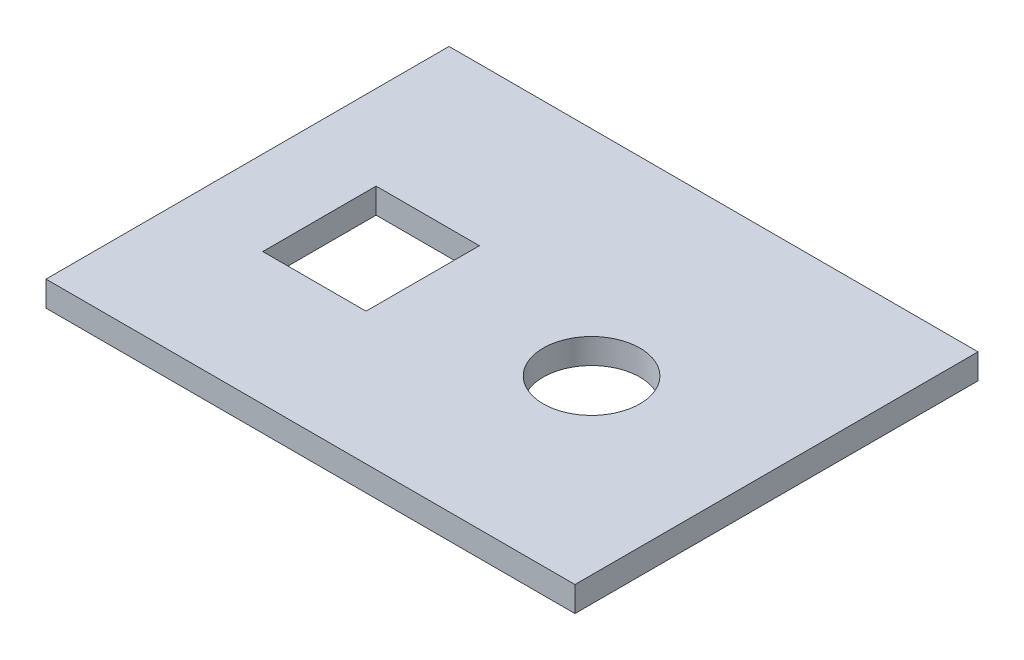
ISO-10303-21;
HEADER;
FILE_DESCRIPTION(('STEP AP214'),'2;1');
FILE_NAME('part.step','',(''),(''),'','','');
FILE_SCHEMA(('AUTOMOTIVE_DESIGN { 1 0 10303 214 1 1 1 1 }'));
ENDSEC;
DATA;
#1=APPLICATION_CONTEXT('core data for automotive mechanical design processes');
#2=APPLICATION_PROTOCOL_DEFINITION('international standard','automotive_design',2000,#1);
#3=PRODUCT_CONTEXT('',#1,'mechanical');
#4=PRODUCT('Part','Part','',(#3));
#5=PRODUCT_RELATED_PRODUCT_CATEGORY('part','',(#4));
#6=PRODUCT_DEFINITION_FORMATION('','',#4);
#7=PRODUCT_DEFINITION_CONTEXT('part definition',#1,'design');
#8=PRODUCT_DEFINITION('design','',#6,#7);
#9=PRODUCT_DEFINITION_SHAPE('','',#8);
#10=(LENGTH_UNIT() NAMED_UNIT(*) SI_UNIT(.MILLI.,.METRE.));
#11=(NAMED_UNIT(*) PLANE_ANGLE_UNIT() SI_UNIT($,.RADIAN.));
#12=(NAMED_UNIT(*) SI_UNIT($,.STERADIAN.) SOLID_ANGLE_UNIT());
#13=UNCERTAINTY_MEASURE_WITH_UNIT(LENGTH_MEASURE(1.E-05),#10,'distance_accuracy_value','');
#14=(GEOMETRIC_REPRESENTATION_CONTEXT(3) GLOBAL_UNCERTAINTY_ASSIGNED_CONTEXT((#13)) GLOBAL_UNIT_ASSIGNED_CONTEXT((#10,
#11,#12)) REPRESENTATION_CONTEXT('',''));
#15=CARTESIAN_POINT('',(0.,0.,0.));
#16=DIRECTION('',(0.,0.,1.));
#17=DIRECTION('',(1.,0.,0.));
#18=AXIS2_PLACEMENT_3D('',#15,#16,#17);
#19=CARTESIAN_POINT('',(0.,10.,0.));
#20=DIRECTION('',(0.,1.,0.));
#21=DIRECTION('',(0.,0.,1.));
#22=AXIS2_PLACEMENT_3D('',#19,#20,#21);
#23=PLANE('',#22);
#24=DIRECTION('',(-1.,0.,0.));
#25=VECTOR('',#24,1.);
#26=CARTESIAN_POINT('',(0.,10.,22.5));
#27=LINE('',#26,#25);
#28=CARTESIAN_POINT('',(-25.4527074928853,10.,22.5));
#29=VERTEX_POINT('',#28);
#30=CARTESIAN_POINT('',(-66.4527074928853,10.,22.5));
#31=VERTEX_POINT('',#30);
#32=EDGE_CURVE('E186',#29,#31,#27,.T.);
#33=ORIENTED_EDGE('',*,*,#32,.T.);
#34=DIRECTION('',(0.,0.,-1.));
#35=VECTOR('',#34,1.);
#36=CARTESIAN_POINT('',(-66.4527074928853,10.,0.));
#37=LINE('',#36,#35);
#38=CARTESIAN_POINT('',(-66.4527074928853,10.,-22.5));
#39=VERTEX_POINT('',#38);
#40=EDGE_CURVE('E182',#31,#39,#37,.T.);
#41=ORIENTED_EDGE('',*,*,#40,.T.);
#42=DIRECTION('',(1.,0.,0.));
#43=VECTOR('',#42,1.);
#44=CARTESIAN_POINT('',(0.,10.,-22.5));
#45=LINE('',#44,#43);
#46=CARTESIAN_POINT('',(-25.4527074928853,10.,-22.5));
#47=VERTEX_POINT('',#46);
#48=EDGE_CURVE('E192',#39,#47,#45,.T.);
#49=ORIENTED_EDGE('',*,*,#48,.T.);
#50=DIRECTION('',(0.,0.,1.));
#51=VECTOR('',#50,1.);
#52=CARTESIAN_POINT('',(-25.4527074928853,10.,0.));
#53=LINE('',#52,#51);
#54=EDGE_CURVE('E122',#47,#29,#53,.T.);
#55=ORIENTED_EDGE('',*,*,#54,.T.);
#56=EDGE_LOOP('',(#33,#41,#49,#55));
#57=FACE_BOUND('',#56,.T.);
#58=DIRECTION('',(-1.,0.,0.));
#59=VECTOR('',#58,1.);
#60=CARTESIAN_POINT('',(110.,10.,-85.));
#61=LINE('',#60,#59);
#62=CARTESIAN_POINT('',(110.,10.,-85.));
#63=VERTEX_POINT('',#62);
#64=CARTESIAN_POINT('',(-100.,10.,-85.));
#65=VERTEX_POINT('',#64);
#66=EDGE_CURVE('E152',#63,#65,#61,.T.);
#67=ORIENTED_EDGE('',*,*,#66,.T.);
#68=DIRECTION('',(0.,0.,1.));
#69=VECTOR('',#68,1.);
#70=CARTESIAN_POINT('',(-100.,10.,-85.));
#71=LINE('',#70,#69);
#72=CARTESIAN_POINT('',(-100.,10.,75.));
#73=VERTEX_POINT('',#72);
#74=EDGE_CURVE('E173',#65,#73,#71,.T.);
#75=ORIENTED_EDGE('',*,*,#74,.T.);
#76=DIRECTION('',(-1.,0.,0.));
#77=VECTOR('',#76,1.);
#78=CARTESIAN_POINT('',(110.,10.,75.));
#79=LINE('',#78,#77);
#80=CARTESIAN_POINT('',(110.,10.,75.));
#81=VERTEX_POINT('',#80);
#82=EDGE_CURVE('E169',#81,#73,#79,.T.);
#83=ORIENTED_EDGE('',*,*,#82,.F.);
#84=DIRECTION('',(0.,0.,1.));
#85=VECTOR('',#84,1.);
#86=CARTESIAN_POINT('',(110.,10.,-85.));
#87=LINE('',#86,#85);
#88=EDGE_CURVE('E147',#63,#81,#87,.T.);
#89=ORIENTED_EDGE('',*,*,#88,.F.);
#90=EDGE_LOOP('',(#67,#75,#83,#89));
#91=FACE_BOUND('',#90,.T.);
#92=CARTESIAN_POINT('',(41.585,10.,0.));
#93=DIRECTION('',(0.,1.,0.));
#94=DIRECTION('',(0.,0.,1.));
#95=AXIS2_PLACEMENT_3D('',#92,#93,#94);
#96=CIRCLE('',#95,19.2);
#97=CARTESIAN_POINT('',(41.585,10.,19.2));
#98=VERTEX_POINT('',#97);
#99=EDGE_CURVE('E165',#98,#98,#96,.F.);
#100=ORIENTED_EDGE('',*,*,#99,.T.);
#101=EDGE_LOOP('',(#100));
#102=FACE_BOUND('',#101,.T.);
#103=ADVANCED_FACE('F45',(#57,#91,#102),#23,.T.);
#104=CARTESIAN_POINT('',(0.,0.,0.));
#105=DIRECTION('',(0.,1.,0.));
#106=DIRECTION('',(0.,0.,1.));
#107=AXIS2_PLACEMENT_3D('',#104,#105,#106);
#108=PLANE('',#107);
#109=DIRECTION('',(-1.,0.,0.));
#110=VECTOR('',#109,1.);
#111=CARTESIAN_POINT('',(110.,0.,-85.));
#112=LINE('',#111,#110);
#113=CARTESIAN_POINT('',(110.,0.,-85.));
#114=VERTEX_POINT('',#113);
#115=CARTESIAN_POINT('',(-100.,0.,-85.));
#116=VERTEX_POINT('',#115);
#117=EDGE_CURVE('E161',#114,#116,#112,.T.);
#118=ORIENTED_EDGE('',*,*,#117,.F.);
#119=DIRECTION('',(0.,0.,1.));
#120=VECTOR('',#119,1.);
#121=CARTESIAN_POINT('',(110.,0.,-85.));
#122=LINE('',#121,#120);
#123=CARTESIAN_POINT('',(110.,0.,75.));
#124=VERTEX_POINT('',#123);
#125=EDGE_CURVE('E148',#114,#124,#122,.T.);
#126=ORIENTED_EDGE('',*,*,#125,.T.);
#127=DIRECTION('',(-1.,0.,0.));
#128=VECTOR('',#127,1.);
#129=CARTESIAN_POINT('',(110.,0.,75.));
#130=LINE('',#129,#128);
#131=CARTESIAN_POINT('',(-100.,0.,75.));
#132=VERTEX_POINT('',#131);
#133=EDGE_CURVE('E153',#124,#132,#130,.T.);
#134=ORIENTED_EDGE('',*,*,#133,.T.);
#135=DIRECTION('',(0.,0.,1.));
#136=VECTOR('',#135,1.);
#137=CARTESIAN_POINT('',(-100.,0.,-85.));
#138=LINE('',#137,#136);
#139=EDGE_CURVE('E157',#116,#132,#138,.T.);
#140=ORIENTED_EDGE('',*,*,#139,.F.);
#141=EDGE_LOOP('',(#118,#126,#134,#140));
#142=FACE_BOUND('',#141,.T.);
#143=DIRECTION('',(0.,0.,-1.));
#144=VECTOR('',#143,1.);
#145=CARTESIAN_POINT('',(-66.4527074928853,0.,0.));
#146=LINE('',#145,#144);
#147=CARTESIAN_POINT('',(-66.4527074928853,0.,22.5));
#148=VERTEX_POINT('',#147);
#149=CARTESIAN_POINT('',(-66.4527074928853,0.,-22.5));
#150=VERTEX_POINT('',#149);
#151=EDGE_CURVE('E11',#148,#150,#146,.T.);
#152=ORIENTED_EDGE('',*,*,#151,.F.);
#153=DIRECTION('',(-1.,0.,0.));
#154=VECTOR('',#153,1.);
#155=CARTESIAN_POINT('',(0.,0.,22.5));
#156=LINE('',#155,#154);
#157=CARTESIAN_POINT('',(-25.4527074928853,0.,22.5));
#158=VERTEX_POINT('',#157);
#159=EDGE_CURVE('E55',#158,#148,#156,.T.);
#160=ORIENTED_EDGE('',*,*,#159,.F.);
#161=DIRECTION('',(0.,0.,1.));
#162=VECTOR('',#161,1.);
#163=CARTESIAN_POINT('',(-25.4527074928853,0.,0.));
#164=LINE('',#163,#162);
#165=CARTESIAN_POINT('',(-25.4527074928853,0.,-22.5));
#166=VERTEX_POINT('',#165);
#167=EDGE_CURVE('E114',#166,#158,#164,.T.);
#168=ORIENTED_EDGE('',*,*,#167,.F.);
#169=DIRECTION('',(1.,0.,0.));
#170=VECTOR('',#169,1.);
#171=CARTESIAN_POINT('',(0.,0.,-22.5));
#172=LINE('',#171,#170);
#173=EDGE_CURVE('E108',#150,#166,#172,.T.);
#174=ORIENTED_EDGE('',*,*,#173,.F.);
#175=EDGE_LOOP('',(#152,#160,#168,#174));
#176=FACE_BOUND('',#175,.T.);
#177=CARTESIAN_POINT('',(41.585,0.,0.));
#178=DIRECTION('',(0.,1.,0.));
#179=DIRECTION('',(0.,0.,1.));
#180=AXIS2_PLACEMENT_3D('',#177,#178,#179);
#181=CIRCLE('',#180,19.2);
#182=CARTESIAN_POINT('',(41.585,0.,19.2));
#183=VERTEX_POINT('',#182);
#184=EDGE_CURVE('E49',#183,#183,#181,.F.);
#185=ORIENTED_EDGE('',*,*,#184,.F.);
#186=EDGE_LOOP('',(#185));
#187=FACE_BOUND('',#186,.T.);
#188=ADVANCED_FACE('F128',(#142,#176,#187),#108,.F.);
#189=CARTESIAN_POINT('',(110.,10.,-85.));
#190=DIRECTION('',(0.,0.,1.));
#191=DIRECTION('',(1.,0.,0.));
#192=AXIS2_PLACEMENT_3D('',#189,#190,#191);
#193=PLANE('',#192);
#194=ORIENTED_EDGE('',*,*,#117,.T.);
#195=DIRECTION('',(0.,-1.,0.));
#196=VECTOR('',#195,1.);
#197=CARTESIAN_POINT('',(-100.,10.,-85.));
#198=LINE('',#197,#196);
#199=EDGE_CURVE('E115',#65,#116,#198,.T.);
#200=ORIENTED_EDGE('',*,*,#199,.F.);
#201=ORIENTED_EDGE('',*,*,#66,.F.);
#202=DIRECTION('',(0.,-1.,0.));
#203=VECTOR('',#202,1.);
#204=CARTESIAN_POINT('',(110.,10.,-85.));
#205=LINE('',#204,#203);
#206=EDGE_CURVE('E144',#63,#114,#205,.T.);
#207=ORIENTED_EDGE('',*,*,#206,.T.);
#208=EDGE_LOOP('',(#194,#200,#201,#207));
#209=FACE_BOUND('',#208,.T.);
#210=ADVANCED_FACE('F47',(#209),#193,.F.);
#211=CARTESIAN_POINT('',(-100.,10.,-85.));
#212=DIRECTION('',(1.,0.,0.));
#213=DIRECTION('',(0.,0.,-1.));
#214=AXIS2_PLACEMENT_3D('',#211,#212,#213);
#215=PLANE('',#214);
#216=ORIENTED_EDGE('',*,*,#139,.T.);
#217=DIRECTION('',(0.,-1.,0.));
#218=VECTOR('',#217,1.);
#219=CARTESIAN_POINT('',(-100.,10.,75.));
#220=LINE('',#219,#218);
#221=EDGE_CURVE('E138',#73,#132,#220,.T.);
#222=ORIENTED_EDGE('',*,*,#221,.F.);
#223=ORIENTED_EDGE('',*,*,#74,.F.);
#224=ORIENTED_EDGE('',*,*,#199,.T.);
#225=EDGE_LOOP('',(#216,#222,#223,#224));
#226=FACE_BOUND('',#225,.T.);
#227=ADVANCED_FACE('F231',(#226),#215,.F.);
#228=CARTESIAN_POINT('',(110.,10.,75.));
#229=DIRECTION('',(0.,0.,1.));
#230=DIRECTION('',(1.,0.,0.));
#231=AXIS2_PLACEMENT_3D('',#228,#229,#230);
#232=PLANE('',#231);
#233=ORIENTED_EDGE('',*,*,#133,.F.);
#234=DIRECTION('',(0.,-1.,0.));
#235=VECTOR('',#234,1.);
#236=CARTESIAN_POINT('',(110.,10.,75.));
#237=LINE('',#236,#235);
#238=EDGE_CURVE('E141',#81,#124,#237,.T.);
#239=ORIENTED_EDGE('',*,*,#238,.F.);
#240=ORIENTED_EDGE('',*,*,#82,.T.);
#241=ORIENTED_EDGE('',*,*,#221,.T.);
#242=EDGE_LOOP('',(#233,#239,#240,#241));
#243=FACE_BOUND('',#242,.T.);
#244=ADVANCED_FACE('F239',(#243),#232,.T.);
#245=CARTESIAN_POINT('',(110.,10.,-85.));
#246=DIRECTION('',(1.,0.,0.));
#247=DIRECTION('',(0.,0.,-1.));
#248=AXIS2_PLACEMENT_3D('',#245,#246,#247);
#249=PLANE('',#248);
#250=ORIENTED_EDGE('',*,*,#125,.F.);
#251=ORIENTED_EDGE('',*,*,#206,.F.);
#252=ORIENTED_EDGE('',*,*,#88,.T.);
#253=ORIENTED_EDGE('',*,*,#238,.T.);
#254=EDGE_LOOP('',(#250,#251,#252,#253));
#255=FACE_BOUND('',#254,.T.);
#256=ADVANCED_FACE('F236',(#255),#249,.T.);
#257=CARTESIAN_POINT('',(-66.4527074928853,15.,22.5));
#258=DIRECTION('',(1.,0.,0.));
#259=DIRECTION('',(0.,0.,-1.));
#260=AXIS2_PLACEMENT_3D('',#257,#258,#259);
#261=PLANE('',#260);
#262=DIRECTION('',(0.,-1.,0.));
#263=VECTOR('',#262,1.);
#264=CARTESIAN_POINT('',(-66.4527074928853,15.,22.5));
#265=LINE('',#264,#263);
#266=EDGE_CURVE('E199',#31,#148,#265,.T.);
#267=ORIENTED_EDGE('',*,*,#266,.T.);
#268=ORIENTED_EDGE('',*,*,#151,.T.);
#269=DIRECTION('',(0.,-1.,0.));
#270=VECTOR('',#269,1.);
#271=CARTESIAN_POINT('',(-66.4527074928853,15.,-22.5));
#272=LINE('',#271,#270);
#273=EDGE_CURVE('E67',#39,#150,#272,.T.);
#274=ORIENTED_EDGE('',*,*,#273,.F.);
#275=ORIENTED_EDGE('',*,*,#40,.F.);
#276=EDGE_LOOP('',(#267,#268,#274,#275));
#277=FACE_BOUND('',#276,.T.);
#278=ADVANCED_FACE('F204',(#277),#261,.T.);
#279=CARTESIAN_POINT('',(-66.4527074928853,15.,22.5));
#280=DIRECTION('',(0.,0.,-1.));
#281=DIRECTION('',(-1.,0.,0.));
#282=AXIS2_PLACEMENT_3D('',#279,#280,#281);
#283=PLANE('',#282);
#284=DIRECTION('',(0.,-1.,0.));
#285=VECTOR('',#284,1.);
#286=CARTESIAN_POINT('',(-25.4527074928853,15.,22.5));
#287=LINE('',#286,#285);
#288=EDGE_CURVE('E125',#29,#158,#287,.T.);
#289=ORIENTED_EDGE('',*,*,#288,.T.);
#290=ORIENTED_EDGE('',*,*,#159,.T.);
#291=ORIENTED_EDGE('',*,*,#266,.F.);
#292=ORIENTED_EDGE('',*,*,#32,.F.);
#293=EDGE_LOOP('',(#289,#290,#291,#292));
#294=FACE_BOUND('',#293,.T.);
#295=ADVANCED_FACE('F206',(#294),#283,.T.);
#296=CARTESIAN_POINT('',(-25.4527074928853,15.,22.5));
#297=DIRECTION('',(-1.,0.,0.));
#298=DIRECTION('',(0.,0.,1.));
#299=AXIS2_PLACEMENT_3D('',#296,#297,#298);
#300=PLANE('',#299);
#301=DIRECTION('',(0.,-1.,0.));
#302=VECTOR('',#301,1.);
#303=CARTESIAN_POINT('',(-25.4527074928853,15.,-22.5));
#304=LINE('',#303,#302);
#305=EDGE_CURVE('E62',#47,#166,#304,.T.);
#306=ORIENTED_EDGE('',*,*,#305,.T.);
#307=ORIENTED_EDGE('',*,*,#167,.T.);
#308=ORIENTED_EDGE('',*,*,#288,.F.);
#309=ORIENTED_EDGE('',*,*,#54,.F.);
#310=EDGE_LOOP('',(#306,#307,#308,#309));
#311=FACE_BOUND('',#310,.T.);
#312=ADVANCED_FACE('F118',(#311),#300,.T.);
#313=CARTESIAN_POINT('',(-66.4527074928853,15.,-22.5));
#314=DIRECTION('',(0.,0.,1.));
#315=DIRECTION('',(1.,0.,0.));
#316=AXIS2_PLACEMENT_3D('',#313,#314,#315);
#317=PLANE('',#316);
#318=ORIENTED_EDGE('',*,*,#273,.T.);
#319=ORIENTED_EDGE('',*,*,#173,.T.);
#320=ORIENTED_EDGE('',*,*,#305,.F.);
#321=ORIENTED_EDGE('',*,*,#48,.F.);
#322=EDGE_LOOP('',(#318,#319,#320,#321));
#323=FACE_BOUND('',#322,.T.);
#324=ADVANCED_FACE('F109',(#323),#317,.T.);
#325=CARTESIAN_POINT('',(41.585,15.,0.));
#326=DIRECTION('',(0.,-1.,0.));
#327=DIRECTION('',(0.,0.,-1.));
#328=AXIS2_PLACEMENT_3D('',#325,#326,#327);
#329=CYLINDRICAL_SURFACE('',#328,19.2);
#330=ORIENTED_EDGE('',*,*,#99,.F.);
#331=EDGE_LOOP('',(#330));
#332=FACE_BOUND('',#331,.T.);
#333=ORIENTED_EDGE('',*,*,#184,.T.);
#334=EDGE_LOOP('',(#333));
#335=FACE_BOUND('',#334,.T.);
#336=ADVANCED_FACE('F217',(#332,#335),#329,.F.);
#337=CLOSED_SHELL('',(#103,#188,#210,#227,#244,#256,#278,#295,#312,#324,#336));
#338=MANIFOLD_SOLID_BREP('B2',#337);
#339=ADVANCED_BREP_SHAPE_REPRESENTATION('',(#18,#338),#14);
#340=SHAPE_DEFINITION_REPRESENTATION(#9,#339);
ENDSEC;
END-ISO-10303-21;
